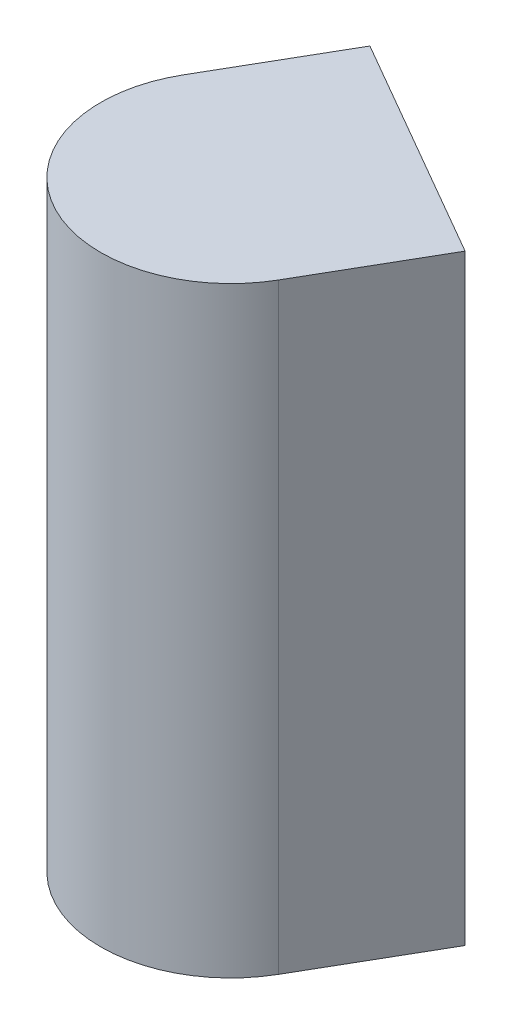
ISO-10303-21;
HEADER;
FILE_DESCRIPTION(('STEP AP214'),'2;1');
FILE_NAME('part.step','',(''),(''),'','','');
FILE_SCHEMA(('AUTOMOTIVE_DESIGN { 1 0 10303 214 1 1 1 1 }'));
ENDSEC;
DATA;
#1=APPLICATION_CONTEXT('core data for automotive mechanical design processes');
#2=APPLICATION_PROTOCOL_DEFINITION('international standard','automotive_design',2000,#1);
#3=PRODUCT_CONTEXT('',#1,'mechanical');
#4=PRODUCT('Part','Part','',(#3));
#5=PRODUCT_RELATED_PRODUCT_CATEGORY('part','',(#4));
#6=PRODUCT_DEFINITION_FORMATION('','',#4);
#7=PRODUCT_DEFINITION_CONTEXT('part definition',#1,'design');
#8=PRODUCT_DEFINITION('design','',#6,#7);
#9=PRODUCT_DEFINITION_SHAPE('','',#8);
#10=(LENGTH_UNIT() NAMED_UNIT(*) SI_UNIT(.MILLI.,.METRE.));
#11=(NAMED_UNIT(*) PLANE_ANGLE_UNIT() SI_UNIT($,.RADIAN.));
#12=(NAMED_UNIT(*) SI_UNIT($,.STERADIAN.) SOLID_ANGLE_UNIT());
#13=UNCERTAINTY_MEASURE_WITH_UNIT(LENGTH_MEASURE(1.E-05),#10,'distance_accuracy_value','');
#14=(GEOMETRIC_REPRESENTATION_CONTEXT(3) GLOBAL_UNCERTAINTY_ASSIGNED_CONTEXT((#13)) GLOBAL_UNIT_ASSIGNED_CONTEXT((#10,
#11,#12)) REPRESENTATION_CONTEXT('',''));
#15=CARTESIAN_POINT('',(0.,0.,0.));
#16=DIRECTION('',(0.,0.,1.));
#17=DIRECTION('',(1.,0.,0.));
#18=AXIS2_PLACEMENT_3D('',#15,#16,#17);
#19=CARTESIAN_POINT('',(16.1387348175049,18.5,70.5968780517578));
#20=DIRECTION('',(-0.499999980921019,0.,0.866025414799693));
#21=DIRECTION('',(0.866025414799693,0.,0.499999980921019));
#22=AXIS2_PLACEMENT_3D('',#19,#20,#21);
#23=PLANE('',#22);
#24=DIRECTION('',(-0.866025414799693,0.,-0.499999980921019));
#25=VECTOR('',#24,1.);
#26=CARTESIAN_POINT('',(16.1387348175049,0.,70.5968780517578));
#27=LINE('',#26,#25);
#28=CARTESIAN_POINT('',(23.0669384002686,0.,74.5968780517578));
#29=VERTEX_POINT('',#28);
#30=CARTESIAN_POINT('',(16.1387348175049,0.,70.5968780517578));
#31=VERTEX_POINT('',#30);
#32=EDGE_CURVE('E97',#29,#31,#27,.T.);
#33=ORIENTED_EDGE('',*,*,#32,.T.);
#34=DIRECTION('',(0.,-1.,0.));
#35=VECTOR('',#34,1.);
#36=CARTESIAN_POINT('',(16.1387348175049,18.5,70.5968780517578));
#37=LINE('',#36,#35);
#38=CARTESIAN_POINT('',(16.1387348175049,18.5,70.5968780517578));
#39=VERTEX_POINT('',#38);
#40=EDGE_CURVE('E11',#39,#31,#37,.T.);
#41=ORIENTED_EDGE('',*,*,#40,.F.);
#42=DIRECTION('',(-0.866025414799693,0.,-0.499999980921019));
#43=VECTOR('',#42,1.);
#44=CARTESIAN_POINT('',(16.1387348175049,18.5,70.5968780517578));
#45=LINE('',#44,#43);
#46=CARTESIAN_POINT('',(23.0669384002686,18.5,74.5968780517578));
#47=VERTEX_POINT('',#46);
#48=EDGE_CURVE('E85',#47,#39,#45,.T.);
#49=ORIENTED_EDGE('',*,*,#48,.F.);
#50=DIRECTION('',(0.,-1.,0.));
#51=VECTOR('',#50,1.);
#52=CARTESIAN_POINT('',(23.0669384002686,18.5,74.5968780517578));
#53=LINE('',#52,#51);
#54=EDGE_CURVE('E93',#47,#29,#53,.T.);
#55=ORIENTED_EDGE('',*,*,#54,.T.);
#56=EDGE_LOOP('',(#33,#41,#49,#55));
#57=FACE_BOUND('',#56,.T.);
#58=ADVANCED_FACE('F34',(#57),#23,.F.);
#59=CARTESIAN_POINT('',(16.1387348175049,18.5,70.5968780517578));
#60=DIRECTION('',(0.866025483953638,0.,0.499999861142848));
#61=DIRECTION('',(0.499999861142848,0.,-0.866025483953638));
#62=AXIS2_PLACEMENT_3D('',#59,#60,#61);
#63=PLANE('',#62);
#64=DIRECTION('',(-0.499999861142848,0.,0.866025483953638));
#65=VECTOR('',#64,1.);
#66=CARTESIAN_POINT('',(16.1387348175049,0.,70.5968780517578));
#67=LINE('',#66,#65);
#68=CARTESIAN_POINT('',(14.0358991622925,0.,74.2390975952148));
#69=VERTEX_POINT('',#68);
#70=EDGE_CURVE('E89',#31,#69,#67,.T.);
#71=ORIENTED_EDGE('',*,*,#70,.T.);
#72=DIRECTION('',(0.,-1.,0.));
#73=VECTOR('',#72,1.);
#74=CARTESIAN_POINT('',(14.0358991622925,18.5,74.2390975952148));
#75=LINE('',#74,#73);
#76=CARTESIAN_POINT('',(14.0358991622925,18.5,74.2390975952148));
#77=VERTEX_POINT('',#76);
#78=EDGE_CURVE('E42',#77,#69,#75,.T.);
#79=ORIENTED_EDGE('',*,*,#78,.F.);
#80=DIRECTION('',(-0.499999861142848,0.,0.866025483953638));
#81=VECTOR('',#80,1.);
#82=CARTESIAN_POINT('',(16.1387348175049,18.5,70.5968780517578));
#83=LINE('',#82,#81);
#84=EDGE_CURVE('E80',#39,#77,#83,.T.);
#85=ORIENTED_EDGE('',*,*,#84,.F.);
#86=ORIENTED_EDGE('',*,*,#40,.T.);
#87=EDGE_LOOP('',(#71,#79,#85,#86));
#88=FACE_BOUND('',#87,.T.);
#89=ADVANCED_FACE('F88',(#88),#63,.F.);
#90=CARTESIAN_POINT('',(17.5000013113022,18.5,76.2390978016914));
#91=DIRECTION('',(0.,-1.,0.));
#92=DIRECTION('',(0.,0.,-1.));
#93=AXIS2_PLACEMENT_3D('',#90,#91,#92);
#94=CYLINDRICAL_SURFACE('',#93,4.00000056558497);
#95=CARTESIAN_POINT('',(17.5000013113022,0.,76.2390978016914));
#96=DIRECTION('',(0.,1.,0.));
#97=DIRECTION('',(0.,0.,1.));
#98=AXIS2_PLACEMENT_3D('',#95,#96,#97);
#99=CIRCLE('',#98,4.00000056558497);
#100=CARTESIAN_POINT('',(20.9641036987305,0.,78.2390975952148));
#101=VERTEX_POINT('',#100);
#102=EDGE_CURVE('E67',#69,#101,#99,.T.);
#103=ORIENTED_EDGE('',*,*,#102,.T.);
#104=DIRECTION('',(0.,-1.,0.));
#105=VECTOR('',#104,1.);
#106=CARTESIAN_POINT('',(20.9641036987305,18.5,78.2390975952148));
#107=LINE('',#106,#105);
#108=CARTESIAN_POINT('',(20.9641036987305,18.5,78.2390975952148));
#109=VERTEX_POINT('',#108);
#110=EDGE_CURVE('E90',#109,#101,#107,.T.);
#111=ORIENTED_EDGE('',*,*,#110,.F.);
#112=CARTESIAN_POINT('',(17.5000013113022,18.5,76.2390978016914));
#113=DIRECTION('',(0.,1.,0.));
#114=DIRECTION('',(0.,0.,1.));
#115=AXIS2_PLACEMENT_3D('',#112,#113,#114);
#116=CIRCLE('',#115,4.00000056558497);
#117=EDGE_CURVE('E83',#77,#109,#116,.T.);
#118=ORIENTED_EDGE('',*,*,#117,.F.);
#119=ORIENTED_EDGE('',*,*,#78,.T.);
#120=EDGE_LOOP('',(#103,#111,#118,#119));
#121=FACE_BOUND('',#120,.T.);
#122=ADVANCED_FACE('F91',(#121),#94,.T.);
#123=CARTESIAN_POINT('',(23.0669384002686,18.5,74.5968780517578));
#124=DIRECTION('',(-0.866025582143165,0.,-0.499999691073497));
#125=DIRECTION('',(-0.499999691073497,0.,0.866025582143165));
#126=AXIS2_PLACEMENT_3D('',#123,#124,#125);
#127=PLANE('',#126);
#128=DIRECTION('',(0.499999691073497,0.,-0.866025582143165));
#129=VECTOR('',#128,1.);
#130=CARTESIAN_POINT('',(23.0669384002686,0.,74.5968780517578));
#131=LINE('',#130,#129);
#132=EDGE_CURVE('E73',#101,#29,#131,.T.);
#133=ORIENTED_EDGE('',*,*,#132,.T.);
#134=ORIENTED_EDGE('',*,*,#54,.F.);
#135=DIRECTION('',(0.499999691073497,0.,-0.866025582143165));
#136=VECTOR('',#135,1.);
#137=CARTESIAN_POINT('',(23.0669384002686,18.5,74.5968780517578));
#138=LINE('',#137,#136);
#139=EDGE_CURVE('E50',#109,#47,#138,.T.);
#140=ORIENTED_EDGE('',*,*,#139,.F.);
#141=ORIENTED_EDGE('',*,*,#110,.T.);
#142=EDGE_LOOP('',(#133,#134,#140,#141));
#143=FACE_BOUND('',#142,.T.);
#144=ADVANCED_FACE('F104',(#143),#127,.F.);
#145=CARTESIAN_POINT('',(17.5000013113022,18.5,76.2390978016914));
#146=DIRECTION('',(0.,1.,0.));
#147=DIRECTION('',(0.,0.,1.));
#148=AXIS2_PLACEMENT_3D('',#145,#146,#147);
#149=PLANE('',#148);
#150=ORIENTED_EDGE('',*,*,#48,.T.);
#151=ORIENTED_EDGE('',*,*,#84,.T.);
#152=ORIENTED_EDGE('',*,*,#117,.T.);
#153=ORIENTED_EDGE('',*,*,#139,.T.);
#154=EDGE_LOOP('',(#150,#151,#152,#153));
#155=FACE_BOUND('',#154,.T.);
#156=ADVANCED_FACE('F81',(#155),#149,.T.);
#157=CARTESIAN_POINT('',(17.5000013113022,0.,76.2390978016914));
#158=DIRECTION('',(0.,1.,0.));
#159=DIRECTION('',(0.,0.,1.));
#160=AXIS2_PLACEMENT_3D('',#157,#158,#159);
#161=PLANE('',#160);
#162=ORIENTED_EDGE('',*,*,#32,.F.);
#163=ORIENTED_EDGE('',*,*,#132,.F.);
#164=ORIENTED_EDGE('',*,*,#102,.F.);
#165=ORIENTED_EDGE('',*,*,#70,.F.);
#166=EDGE_LOOP('',(#162,#163,#164,#165));
#167=FACE_BOUND('',#166,.T.);
#168=ADVANCED_FACE('F107',(#167),#161,.F.);
#169=CLOSED_SHELL('',(#58,#89,#122,#144,#156,#168));
#170=MANIFOLD_SOLID_BREP('B2',#169);
#171=ADVANCED_BREP_SHAPE_REPRESENTATION('',(#18,#170),#14);
#172=SHAPE_DEFINITION_REPRESENTATION(#9,#171);
ENDSEC;
END-ISO-10303-21;
